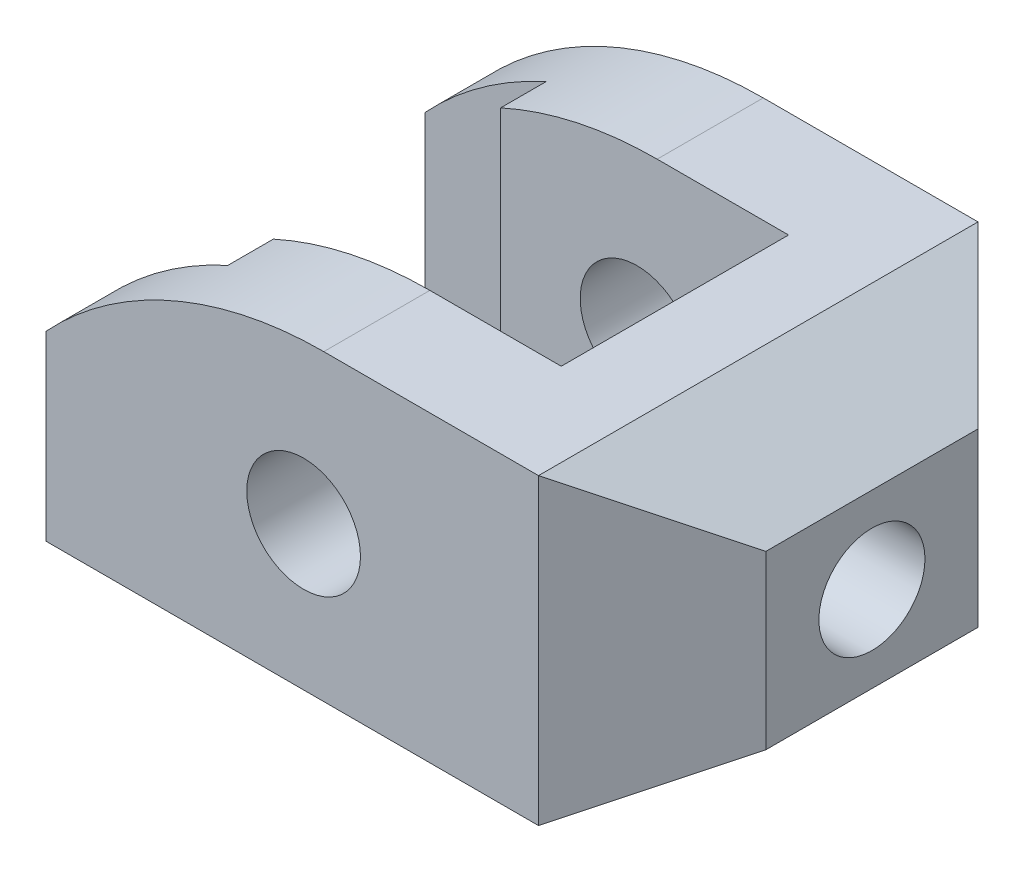
ISO-10303-21;
HEADER;
FILE_DESCRIPTION(('STEP AP214'),'2;1');
FILE_NAME('part.step','',(''),(''),'','','');
FILE_SCHEMA(('AUTOMOTIVE_DESIGN { 1 0 10303 214 1 1 1 1 }'));
ENDSEC;
DATA;
#1=APPLICATION_CONTEXT('core data for automotive mechanical design processes');
#2=APPLICATION_PROTOCOL_DEFINITION('international standard','automotive_design',2000,#1);
#3=PRODUCT_CONTEXT('',#1,'mechanical');
#4=PRODUCT('Part','Part','',(#3));
#5=PRODUCT_RELATED_PRODUCT_CATEGORY('part','',(#4));
#6=PRODUCT_DEFINITION_FORMATION('','',#4);
#7=PRODUCT_DEFINITION_CONTEXT('part definition',#1,'design');
#8=PRODUCT_DEFINITION('design','',#6,#7);
#9=PRODUCT_DEFINITION_SHAPE('','',#8);
#10=(LENGTH_UNIT() NAMED_UNIT(*) SI_UNIT(.MILLI.,.METRE.));
#11=(NAMED_UNIT(*) PLANE_ANGLE_UNIT() SI_UNIT($,.RADIAN.));
#12=(NAMED_UNIT(*) SI_UNIT($,.STERADIAN.) SOLID_ANGLE_UNIT());
#13=UNCERTAINTY_MEASURE_WITH_UNIT(LENGTH_MEASURE(1.E-05),#10,'distance_accuracy_value','');
#14=(GEOMETRIC_REPRESENTATION_CONTEXT(3) GLOBAL_UNCERTAINTY_ASSIGNED_CONTEXT((#13)) GLOBAL_UNIT_ASSIGNED_CONTEXT((#10,
#11,#12)) REPRESENTATION_CONTEXT('',''));
#15=CARTESIAN_POINT('',(0.,0.,0.));
#16=DIRECTION('',(0.,0.,1.));
#17=DIRECTION('',(1.,0.,0.));
#18=AXIS2_PLACEMENT_3D('',#15,#16,#17);
#19=CARTESIAN_POINT('',(2.66060555964671,-29.,58.));
#20=DIRECTION('',(0.,0.,-1.));
#21=DIRECTION('',(-1.,0.,0.));
#22=AXIS2_PLACEMENT_3D('',#19,#20,#21);
#23=PLANE('',#22);
#24=CARTESIAN_POINT('',(0.,0.,58.));
#25=DIRECTION('',(0.,0.,1.));
#26=DIRECTION('',(1.,0.,0.));
#27=AXIS2_PLACEMENT_3D('',#24,#25,#26);
#28=CIRCLE('',#27,7.5);
#29=CARTESIAN_POINT('',(7.5,0.,58.));
#30=VERTEX_POINT('',#29);
#31=EDGE_CURVE('E254',#30,#30,#28,.T.);
#32=ORIENTED_EDGE('',*,*,#31,.F.);
#33=EDGE_LOOP('',(#32));
#34=FACE_BOUND('',#33,.T.);
#35=DIRECTION('',(0.,-1.,0.));
#36=VECTOR('',#35,1.);
#37=CARTESIAN_POINT('',(31.,24.,58.));
#38=LINE('',#37,#36);
#39=CARTESIAN_POINT('',(31.,21.,58.));
#40=VERTEX_POINT('',#39);
#41=CARTESIAN_POINT('',(31.,-19.,58.));
#42=VERTEX_POINT('',#41);
#43=EDGE_CURVE('E158',#40,#42,#38,.T.);
#44=ORIENTED_EDGE('',*,*,#43,.F.);
#45=DIRECTION('',(-1.,0.,0.));
#46=VECTOR('',#45,1.);
#47=CARTESIAN_POINT('',(31.,21.,58.));
#48=LINE('',#47,#46);
#49=CARTESIAN_POINT('',(2.66060555964671,21.,58.));
#50=VERTEX_POINT('',#49);
#51=EDGE_CURVE('E219',#40,#50,#48,.T.);
#52=ORIENTED_EDGE('',*,*,#51,.T.);
#53=CARTESIAN_POINT('',(2.66060555964671,-29.,58.));
#54=DIRECTION('',(0.,0.,1.));
#55=DIRECTION('',(-1.,0.,0.));
#56=AXIS2_PLACEMENT_3D('',#53,#54,#55);
#57=CIRCLE('',#56,50.);
#58=CARTESIAN_POINT('',(-34.,5.,58.));
#59=VERTEX_POINT('',#58);
#60=EDGE_CURVE('E239',#50,#59,#57,.T.);
#61=ORIENTED_EDGE('',*,*,#60,.T.);
#62=DIRECTION('',(0.,-1.,0.));
#63=VECTOR('',#62,1.);
#64=CARTESIAN_POINT('',(-34.,-19.,58.));
#65=LINE('',#64,#63);
#66=CARTESIAN_POINT('',(-34.,-19.,58.));
#67=VERTEX_POINT('',#66);
#68=EDGE_CURVE('E245',#59,#67,#65,.T.);
#69=ORIENTED_EDGE('',*,*,#68,.T.);
#70=DIRECTION('',(1.,0.,0.));
#71=VECTOR('',#70,1.);
#72=CARTESIAN_POINT('',(-34.,-19.,58.));
#73=LINE('',#72,#71);
#74=EDGE_CURVE('E222',#67,#42,#73,.T.);
#75=ORIENTED_EDGE('',*,*,#74,.T.);
#76=EDGE_LOOP('',(#44,#52,#61,#69,#75));
#77=FACE_BOUND('',#76,.T.);
#78=ADVANCED_FACE('F44',(#34,#77),#23,.F.);
#79=CARTESIAN_POINT('',(2.66060555964671,-29.,0.));
#80=DIRECTION('',(0.,0.,-1.));
#81=DIRECTION('',(-1.,0.,0.));
#82=AXIS2_PLACEMENT_3D('',#79,#80,#81);
#83=PLANE('',#82);
#84=CARTESIAN_POINT('',(0.,0.,0.));
#85=DIRECTION('',(0.,0.,1.));
#86=DIRECTION('',(1.,0.,0.));
#87=AXIS2_PLACEMENT_3D('',#84,#85,#86);
#88=CIRCLE('',#87,7.5);
#89=CARTESIAN_POINT('',(7.5,0.,0.));
#90=VERTEX_POINT('',#89);
#91=EDGE_CURVE('E375',#90,#90,#88,.T.);
#92=ORIENTED_EDGE('',*,*,#91,.T.);
#93=EDGE_LOOP('',(#92));
#94=FACE_BOUND('',#93,.T.);
#95=DIRECTION('',(-1.,0.,0.));
#96=VECTOR('',#95,1.);
#97=CARTESIAN_POINT('',(31.,21.,0.));
#98=LINE('',#97,#96);
#99=CARTESIAN_POINT('',(31.,21.,0.));
#100=VERTEX_POINT('',#99);
#101=CARTESIAN_POINT('',(2.66060555964671,21.,0.));
#102=VERTEX_POINT('',#101);
#103=EDGE_CURVE('E258',#100,#102,#98,.T.);
#104=ORIENTED_EDGE('',*,*,#103,.F.);
#105=DIRECTION('',(0.,-1.,0.));
#106=VECTOR('',#105,1.);
#107=CARTESIAN_POINT('',(31.,24.,0.));
#108=LINE('',#107,#106);
#109=CARTESIAN_POINT('',(31.,-19.,0.));
#110=VERTEX_POINT('',#109);
#111=EDGE_CURVE('E176',#100,#110,#108,.T.);
#112=ORIENTED_EDGE('',*,*,#111,.T.);
#113=DIRECTION('',(1.,0.,0.));
#114=VECTOR('',#113,1.);
#115=CARTESIAN_POINT('',(-34.,-19.,0.));
#116=LINE('',#115,#114);
#117=CARTESIAN_POINT('',(-34.,-19.,0.));
#118=VERTEX_POINT('',#117);
#119=EDGE_CURVE('E253',#118,#110,#116,.T.);
#120=ORIENTED_EDGE('',*,*,#119,.F.);
#121=DIRECTION('',(0.,-1.,0.));
#122=VECTOR('',#121,1.);
#123=CARTESIAN_POINT('',(-34.,-19.,0.));
#124=LINE('',#123,#122);
#125=CARTESIAN_POINT('',(-34.,5.,0.));
#126=VERTEX_POINT('',#125);
#127=EDGE_CURVE('E249',#126,#118,#124,.T.);
#128=ORIENTED_EDGE('',*,*,#127,.F.);
#129=CARTESIAN_POINT('',(2.66060555964671,-29.,0.));
#130=DIRECTION('',(0.,0.,1.));
#131=DIRECTION('',(-1.,0.,0.));
#132=AXIS2_PLACEMENT_3D('',#129,#130,#131);
#133=CIRCLE('',#132,50.);
#134=EDGE_CURVE('E261',#102,#126,#133,.T.);
#135=ORIENTED_EDGE('',*,*,#134,.F.);
#136=EDGE_LOOP('',(#104,#112,#120,#128,#135));
#137=FACE_BOUND('',#136,.T.);
#138=ADVANCED_FACE('F285',(#94,#137),#83,.T.);
#139=CARTESIAN_POINT('',(31.,-19.,58.));
#140=DIRECTION('',(-0.500000000000001,0.866025403784438,0.));
#141=DIRECTION('',(-0.866025403784438,-0.500000000000001,0.));
#142=AXIS2_PLACEMENT_3D('',#139,#140,#141);
#143=PLANE('',#142);
#144=DIRECTION('',(-0.65465367070798,-0.37796447300923,-0.654653670707973));
#145=VECTOR('',#144,1.);
#146=CARTESIAN_POINT('',(55.8571428571428,-4.64872188014358,24.8571428571425));
#147=LINE('',#146,#145);
#148=CARTESIAN_POINT('',(46.,-10.3397459621556,14.9999999999998));
#149=VERTEX_POINT('',#148);
#150=EDGE_CURVE('E164',#149,#110,#147,.T.);
#151=ORIENTED_EDGE('',*,*,#150,.F.);
#152=DIRECTION('',(0.,0.,-1.));
#153=VECTOR('',#152,1.);
#154=CARTESIAN_POINT('',(46.,-10.3397459621556,58.));
#155=LINE('',#154,#153);
#156=CARTESIAN_POINT('',(46.,-10.3397459621556,43.0000000000002));
#157=VERTEX_POINT('',#156);
#158=EDGE_CURVE('E172',#157,#149,#155,.T.);
#159=ORIENTED_EDGE('',*,*,#158,.F.);
#160=DIRECTION('',(0.65465367070798,0.37796447300923,-0.654653670707973));
#161=VECTOR('',#160,1.);
#162=CARTESIAN_POINT('',(31.,-19.,58.));
#163=LINE('',#162,#161);
#164=EDGE_CURVE('E155',#42,#157,#163,.T.);
#165=ORIENTED_EDGE('',*,*,#164,.F.);
#166=DIRECTION('',(0.,0.,-1.));
#167=VECTOR('',#166,1.);
#168=CARTESIAN_POINT('',(31.,-19.,58.));
#169=LINE('',#168,#167);
#170=EDGE_CURVE('E181',#42,#110,#169,.T.);
#171=ORIENTED_EDGE('',*,*,#170,.T.);
#172=EDGE_LOOP('',(#151,#159,#165,#171));
#173=FACE_BOUND('',#172,.T.);
#174=ADVANCED_FACE('F179',(#173),#143,.F.);
#175=CARTESIAN_POINT('',(46.,12.3397459621557,58.));
#176=DIRECTION('',(-1.,0.,0.));
#177=DIRECTION('',(0.,0.,1.));
#178=AXIS2_PLACEMENT_3D('',#175,#176,#177);
#179=PLANE('',#178);
#180=CARTESIAN_POINT('',(46.,1.00000000000008,29.));
#181=DIRECTION('',(1.,0.,0.));
#182=DIRECTION('',(0.,0.,-1.));
#183=AXIS2_PLACEMENT_3D('',#180,#181,#182);
#184=CIRCLE('',#183,7.);
#185=CARTESIAN_POINT('',(46.,1.00000000000008,22.));
#186=VERTEX_POINT('',#185);
#187=EDGE_CURVE('E371',#186,#186,#184,.T.);
#188=ORIENTED_EDGE('',*,*,#187,.F.);
#189=EDGE_LOOP('',(#188));
#190=FACE_BOUND('',#189,.T.);
#191=DIRECTION('',(0.,-1.,0.));
#192=VECTOR('',#191,1.);
#193=CARTESIAN_POINT('',(46.,24.,14.9999999999998));
#194=LINE('',#193,#192);
#195=CARTESIAN_POINT('',(46.,12.3397459621557,14.9999999999998));
#196=VERTEX_POINT('',#195);
#197=EDGE_CURVE('E165',#196,#149,#194,.T.);
#198=ORIENTED_EDGE('',*,*,#197,.F.);
#199=DIRECTION('',(0.,0.,-1.));
#200=VECTOR('',#199,1.);
#201=CARTESIAN_POINT('',(46.,12.3397459621557,58.));
#202=LINE('',#201,#200);
#203=CARTESIAN_POINT('',(46.,12.3397459621557,43.0000000000002));
#204=VERTEX_POINT('',#203);
#205=EDGE_CURVE('E174',#204,#196,#202,.T.);
#206=ORIENTED_EDGE('',*,*,#205,.F.);
#207=DIRECTION('',(0.,-1.,0.));
#208=VECTOR('',#207,1.);
#209=CARTESIAN_POINT('',(46.,24.,43.0000000000002));
#210=LINE('',#209,#208);
#211=EDGE_CURVE('E60',#204,#157,#210,.T.);
#212=ORIENTED_EDGE('',*,*,#211,.T.);
#213=ORIENTED_EDGE('',*,*,#158,.T.);
#214=EDGE_LOOP('',(#198,#206,#212,#213));
#215=FACE_BOUND('',#214,.T.);
#216=ADVANCED_FACE('F171',(#190,#215),#179,.F.);
#217=CARTESIAN_POINT('',(31.,21.,58.));
#218=DIRECTION('',(-0.499999999999994,-0.866025403784442,0.));
#219=DIRECTION('',(0.866025403784442,-0.499999999999994,0.));
#220=AXIS2_PLACEMENT_3D('',#217,#218,#219);
#221=PLANE('',#220);
#222=DIRECTION('',(0.654653670707982,-0.377964473009224,0.654653670707974));
#223=VECTOR('',#222,1.);
#224=CARTESIAN_POINT('',(55.8571428571429,6.64872188014377,24.8571428571426));
#225=LINE('',#224,#223);
#226=EDGE_CURVE('E11',#100,#196,#225,.T.);
#227=ORIENTED_EDGE('',*,*,#226,.F.);
#228=DIRECTION('',(0.,0.,-1.));
#229=VECTOR('',#228,1.);
#230=CARTESIAN_POINT('',(31.,21.,58.));
#231=LINE('',#230,#229);
#232=EDGE_CURVE('E187',#40,#100,#231,.T.);
#233=ORIENTED_EDGE('',*,*,#232,.F.);
#234=DIRECTION('',(-0.654653670707982,0.377964473009224,0.654653670707974));
#235=VECTOR('',#234,1.);
#236=CARTESIAN_POINT('',(31.,21.,58.));
#237=LINE('',#236,#235);
#238=EDGE_CURVE('E53',#204,#40,#237,.T.);
#239=ORIENTED_EDGE('',*,*,#238,.F.);
#240=ORIENTED_EDGE('',*,*,#205,.T.);
#241=EDGE_LOOP('',(#227,#233,#239,#240));
#242=FACE_BOUND('',#241,.T.);
#243=ADVANCED_FACE('F228',(#242),#221,.F.);
#244=CARTESIAN_POINT('',(-34.,-19.,58.));
#245=DIRECTION('',(1.,0.,0.));
#246=DIRECTION('',(0.,0.,-1.));
#247=AXIS2_PLACEMENT_3D('',#244,#245,#246);
#248=PLANE('',#247);
#249=DIRECTION('',(0.,0.,-1.));
#250=VECTOR('',#249,1.);
#251=CARTESIAN_POINT('',(-34.,-19.,58.));
#252=LINE('',#251,#250);
#253=CARTESIAN_POINT('',(-34.,-19.,8.));
#254=VERTEX_POINT('',#253);
#255=EDGE_CURVE('E185',#254,#118,#252,.T.);
#256=ORIENTED_EDGE('',*,*,#255,.F.);
#257=DIRECTION('',(0.,1.,0.));
#258=VECTOR('',#257,1.);
#259=CARTESIAN_POINT('',(-34.,-19.,8.));
#260=LINE('',#259,#258);
#261=CARTESIAN_POINT('',(-34.,5.00000000000001,8.));
#262=VERTEX_POINT('',#261);
#263=EDGE_CURVE('E291',#254,#262,#260,.T.);
#264=ORIENTED_EDGE('',*,*,#263,.T.);
#265=DIRECTION('',(0.,0.,-1.));
#266=VECTOR('',#265,1.);
#267=CARTESIAN_POINT('',(-34.,5.,58.));
#268=LINE('',#267,#266);
#269=EDGE_CURVE('E243',#262,#126,#268,.T.);
#270=ORIENTED_EDGE('',*,*,#269,.T.);
#271=ORIENTED_EDGE('',*,*,#127,.T.);
#272=EDGE_LOOP('',(#256,#264,#270,#271));
#273=FACE_BOUND('',#272,.T.);
#274=ADVANCED_FACE('F289',(#273),#248,.F.);
#275=CARTESIAN_POINT('',(-34.,-19.,58.));
#276=DIRECTION('',(0.,1.,0.));
#277=DIRECTION('',(-1.,0.,0.));
#278=AXIS2_PLACEMENT_3D('',#275,#276,#277);
#279=PLANE('',#278);
#280=DIRECTION('',(0.,0.,-1.));
#281=VECTOR('',#280,1.);
#282=CARTESIAN_POINT('',(-18.,-19.,8.));
#283=LINE('',#282,#281);
#284=CARTESIAN_POINT('',(-18.,-19.,14.));
#285=VERTEX_POINT('',#284);
#286=CARTESIAN_POINT('',(-18.,-19.,8.));
#287=VERTEX_POINT('',#286);
#288=EDGE_CURVE('E68',#285,#287,#283,.T.);
#289=ORIENTED_EDGE('',*,*,#288,.T.);
#290=DIRECTION('',(-1.,0.,0.));
#291=VECTOR('',#290,1.);
#292=CARTESIAN_POINT('',(-34.,-19.,8.));
#293=LINE('',#292,#291);
#294=EDGE_CURVE('E300',#287,#254,#293,.T.);
#295=ORIENTED_EDGE('',*,*,#294,.T.);
#296=ORIENTED_EDGE('',*,*,#255,.T.);
#297=ORIENTED_EDGE('',*,*,#119,.T.);
#298=ORIENTED_EDGE('',*,*,#170,.F.);
#299=ORIENTED_EDGE('',*,*,#74,.F.);
#300=CARTESIAN_POINT('',(-34.,-19.,50.));
#301=VERTEX_POINT('',#300);
#302=EDGE_CURVE('E191',#67,#301,#252,.T.);
#303=ORIENTED_EDGE('',*,*,#302,.T.);
#304=DIRECTION('',(1.,0.,0.));
#305=VECTOR('',#304,1.);
#306=CARTESIAN_POINT('',(-34.,-19.,50.));
#307=LINE('',#306,#305);
#308=CARTESIAN_POINT('',(-18.,-19.,50.));
#309=VERTEX_POINT('',#308);
#310=EDGE_CURVE('E326',#301,#309,#307,.T.);
#311=ORIENTED_EDGE('',*,*,#310,.T.);
#312=DIRECTION('',(0.,0.,-1.));
#313=VECTOR('',#312,1.);
#314=CARTESIAN_POINT('',(-18.,-19.,50.));
#315=LINE('',#314,#313);
#316=CARTESIAN_POINT('',(-18.,-19.,44.));
#317=VERTEX_POINT('',#316);
#318=EDGE_CURVE('E314',#309,#317,#315,.T.);
#319=ORIENTED_EDGE('',*,*,#318,.T.);
#320=DIRECTION('',(-1.,0.,0.));
#321=VECTOR('',#320,1.);
#322=CARTESIAN_POINT('',(-34.,-19.,44.));
#323=LINE('',#322,#321);
#324=CARTESIAN_POINT('',(20.,-19.,44.));
#325=VERTEX_POINT('',#324);
#326=EDGE_CURVE('E211',#325,#317,#323,.T.);
#327=ORIENTED_EDGE('',*,*,#326,.F.);
#328=DIRECTION('',(0.,0.,1.));
#329=VECTOR('',#328,1.);
#330=CARTESIAN_POINT('',(20.,-19.,58.));
#331=LINE('',#330,#329);
#332=CARTESIAN_POINT('',(20.,-19.,14.));
#333=VERTEX_POINT('',#332);
#334=EDGE_CURVE('E205',#333,#325,#331,.T.);
#335=ORIENTED_EDGE('',*,*,#334,.F.);
#336=DIRECTION('',(1.,0.,0.));
#337=VECTOR('',#336,1.);
#338=CARTESIAN_POINT('',(-34.,-19.,14.));
#339=LINE('',#338,#337);
#340=EDGE_CURVE('E368',#285,#333,#339,.T.);
#341=ORIENTED_EDGE('',*,*,#340,.F.);
#342=EDGE_LOOP('',(#289,#295,#296,#297,#298,#299,#303,#311,#319,#327,#335,#341));
#343=FACE_BOUND('',#342,.T.);
#344=ADVANCED_FACE('F388',(#343),#279,.F.);
#345=CARTESIAN_POINT('',(31.,21.,58.));
#346=DIRECTION('',(0.,-1.,0.));
#347=DIRECTION('',(1.,0.,0.));
#348=AXIS2_PLACEMENT_3D('',#345,#346,#347);
#349=PLANE('',#348);
#350=DIRECTION('',(-1.,0.,0.));
#351=VECTOR('',#350,1.);
#352=CARTESIAN_POINT('',(31.,21.,14.));
#353=LINE('',#352,#351);
#354=CARTESIAN_POINT('',(20.,21.,14.));
#355=VERTEX_POINT('',#354);
#356=CARTESIAN_POINT('',(2.66060555964671,21.,14.));
#357=VERTEX_POINT('',#356);
#358=EDGE_CURVE('E365',#355,#357,#353,.T.);
#359=ORIENTED_EDGE('',*,*,#358,.F.);
#360=DIRECTION('',(0.,0.,-1.));
#361=VECTOR('',#360,1.);
#362=CARTESIAN_POINT('',(20.,21.,58.));
#363=LINE('',#362,#361);
#364=CARTESIAN_POINT('',(20.,21.,44.));
#365=VERTEX_POINT('',#364);
#366=EDGE_CURVE('E347',#365,#355,#363,.T.);
#367=ORIENTED_EDGE('',*,*,#366,.F.);
#368=DIRECTION('',(1.,0.,0.));
#369=VECTOR('',#368,1.);
#370=CARTESIAN_POINT('',(31.,21.,44.));
#371=LINE('',#370,#369);
#372=CARTESIAN_POINT('',(2.66060555964671,21.,44.));
#373=VERTEX_POINT('',#372);
#374=EDGE_CURVE('E356',#373,#365,#371,.T.);
#375=ORIENTED_EDGE('',*,*,#374,.F.);
#376=DIRECTION('',(0.,0.,-1.));
#377=VECTOR('',#376,1.);
#378=CARTESIAN_POINT('',(2.66060555964671,21.,58.));
#379=LINE('',#378,#377);
#380=EDGE_CURVE('E233',#50,#373,#379,.T.);
#381=ORIENTED_EDGE('',*,*,#380,.F.);
#382=ORIENTED_EDGE('',*,*,#51,.F.);
#383=ORIENTED_EDGE('',*,*,#232,.T.);
#384=ORIENTED_EDGE('',*,*,#103,.T.);
#385=EDGE_CURVE('E269',#357,#102,#379,.T.);
#386=ORIENTED_EDGE('',*,*,#385,.F.);
#387=EDGE_LOOP('',(#359,#367,#375,#381,#382,#383,#384,#386));
#388=FACE_BOUND('',#387,.T.);
#389=ADVANCED_FACE('F234',(#388),#349,.F.);
#390=CARTESIAN_POINT('',(2.66060555964671,-29.,58.));
#391=DIRECTION('',(0.,0.,-1.));
#392=DIRECTION('',(-1.,0.,0.));
#393=AXIS2_PLACEMENT_3D('',#390,#391,#392);
#394=CYLINDRICAL_SURFACE('',#393,50.);
#395=ORIENTED_EDGE('',*,*,#269,.F.);
#396=CARTESIAN_POINT('',(2.66060555964671,-29.,8.));
#397=DIRECTION('',(0.,0.,-1.));
#398=DIRECTION('',(-1.,0.,0.));
#399=AXIS2_PLACEMENT_3D('',#396,#397,#398);
#400=CIRCLE('',#399,50.);
#401=CARTESIAN_POINT('',(-18.,16.5317403347236,8.));
#402=VERTEX_POINT('',#401);
#403=EDGE_CURVE('E199',#262,#402,#400,.T.);
#404=ORIENTED_EDGE('',*,*,#403,.T.);
#405=DIRECTION('',(0.,0.,-1.));
#406=VECTOR('',#405,1.);
#407=CARTESIAN_POINT('',(-18.,16.5317403347236,58.));
#408=LINE('',#407,#406);
#409=CARTESIAN_POINT('',(-18.,16.5317403347236,14.));
#410=VERTEX_POINT('',#409);
#411=EDGE_CURVE('E293',#402,#410,#408,.F.);
#412=ORIENTED_EDGE('',*,*,#411,.T.);
#413=CARTESIAN_POINT('',(2.66060555964671,-29.,14.));
#414=DIRECTION('',(0.,0.,1.));
#415=DIRECTION('',(1.,0.,0.));
#416=AXIS2_PLACEMENT_3D('',#413,#414,#415);
#417=CIRCLE('',#416,50.);
#418=EDGE_CURVE('E210',#357,#410,#417,.T.);
#419=ORIENTED_EDGE('',*,*,#418,.F.);
#420=ORIENTED_EDGE('',*,*,#385,.T.);
#421=ORIENTED_EDGE('',*,*,#134,.T.);
#422=EDGE_LOOP('',(#395,#404,#412,#419,#420,#421));
#423=FACE_BOUND('',#422,.T.);
#424=ADVANCED_FACE('F277',(#423),#394,.T.);
#425=CARTESIAN_POINT('',(2.66060555964671,-29.,44.));
#426=DIRECTION('',(0.,0.,-1.));
#427=DIRECTION('',(-1.,0.,0.));
#428=AXIS2_PLACEMENT_3D('',#425,#426,#427);
#429=CIRCLE('',#428,50.);
#430=CARTESIAN_POINT('',(-18.,16.5317403347236,44.));
#431=VERTEX_POINT('',#430);
#432=EDGE_CURVE('E204',#431,#373,#429,.T.);
#433=ORIENTED_EDGE('',*,*,#432,.F.);
#434=DIRECTION('',(0.,0.,-1.));
#435=VECTOR('',#434,1.);
#436=CARTESIAN_POINT('',(-18.,16.5317403347236,58.));
#437=LINE('',#436,#435);
#438=CARTESIAN_POINT('',(-18.,16.5317403347236,50.));
#439=VERTEX_POINT('',#438);
#440=EDGE_CURVE('E306',#431,#439,#437,.F.);
#441=ORIENTED_EDGE('',*,*,#440,.T.);
#442=CARTESIAN_POINT('',(2.66060555964671,-29.,50.));
#443=DIRECTION('',(0.,0.,1.));
#444=DIRECTION('',(1.,0.,0.));
#445=AXIS2_PLACEMENT_3D('',#442,#443,#444);
#446=CIRCLE('',#445,50.);
#447=CARTESIAN_POINT('',(-34.,5.,50.));
#448=VERTEX_POINT('',#447);
#449=EDGE_CURVE('E335',#439,#448,#446,.T.);
#450=ORIENTED_EDGE('',*,*,#449,.T.);
#451=EDGE_CURVE('E265',#59,#448,#268,.T.);
#452=ORIENTED_EDGE('',*,*,#451,.F.);
#453=ORIENTED_EDGE('',*,*,#60,.F.);
#454=ORIENTED_EDGE('',*,*,#380,.T.);
#455=EDGE_LOOP('',(#433,#441,#450,#452,#453,#454));
#456=FACE_BOUND('',#455,.T.);
#457=ADVANCED_FACE('F425',(#456),#394,.T.);
#458=CARTESIAN_POINT('',(0.,0.,58.));
#459=DIRECTION('',(0.,0.,-1.));
#460=DIRECTION('',(-1.,0.,0.));
#461=AXIS2_PLACEMENT_3D('',#458,#459,#460);
#462=CYLINDRICAL_SURFACE('',#461,7.5);
#463=ORIENTED_EDGE('',*,*,#91,.F.);
#464=EDGE_LOOP('',(#463));
#465=FACE_BOUND('',#464,.T.);
#466=CARTESIAN_POINT('',(0.,0.,14.));
#467=DIRECTION('',(0.,0.,1.));
#468=DIRECTION('',(1.,0.,0.));
#469=AXIS2_PLACEMENT_3D('',#466,#467,#468);
#470=CIRCLE('',#469,7.5);
#471=CARTESIAN_POINT('',(7.5,0.,14.));
#472=VERTEX_POINT('',#471);
#473=EDGE_CURVE('E206',#472,#472,#470,.T.);
#474=ORIENTED_EDGE('',*,*,#473,.T.);
#475=EDGE_LOOP('',(#474));
#476=FACE_BOUND('',#475,.T.);
#477=ADVANCED_FACE('F420',(#465,#476),#462,.F.);
#478=ORIENTED_EDGE('',*,*,#31,.T.);
#479=EDGE_LOOP('',(#478));
#480=FACE_BOUND('',#479,.T.);
#481=CARTESIAN_POINT('',(0.,0.,44.));
#482=DIRECTION('',(0.,0.,-1.));
#483=DIRECTION('',(-1.,0.,0.));
#484=AXIS2_PLACEMENT_3D('',#481,#482,#483);
#485=CIRCLE('',#484,7.5);
#486=CARTESIAN_POINT('',(-7.5,0.,44.));
#487=VERTEX_POINT('',#486);
#488=EDGE_CURVE('E200',#487,#487,#485,.T.);
#489=ORIENTED_EDGE('',*,*,#488,.T.);
#490=EDGE_LOOP('',(#489));
#491=FACE_BOUND('',#490,.T.);
#492=ADVANCED_FACE('F452',(#480,#491),#462,.F.);
#493=CARTESIAN_POINT('',(-34.,1.00000000000008,29.));
#494=DIRECTION('',(1.,0.,0.));
#495=DIRECTION('',(0.,0.,-1.));
#496=AXIS2_PLACEMENT_3D('',#493,#494,#495);
#497=CYLINDRICAL_SURFACE('',#496,7.);
#498=ORIENTED_EDGE('',*,*,#187,.T.);
#499=EDGE_LOOP('',(#498));
#500=FACE_BOUND('',#499,.T.);
#501=CARTESIAN_POINT('',(20.,1.00000000000008,29.));
#502=DIRECTION('',(-1.,0.,0.));
#503=DIRECTION('',(0.,0.,1.));
#504=AXIS2_PLACEMENT_3D('',#501,#502,#503);
#505=CIRCLE('',#504,7.);
#506=CARTESIAN_POINT('',(20.,1.00000000000008,36.));
#507=VERTEX_POINT('',#506);
#508=EDGE_CURVE('E195',#507,#507,#505,.F.);
#509=ORIENTED_EDGE('',*,*,#508,.F.);
#510=EDGE_LOOP('',(#509));
#511=FACE_BOUND('',#510,.T.);
#512=ADVANCED_FACE('F443',(#500,#511),#497,.F.);
#513=ORIENTED_EDGE('',*,*,#451,.T.);
#514=DIRECTION('',(0.,1.,0.));
#515=VECTOR('',#514,1.);
#516=CARTESIAN_POINT('',(-34.,-19.,50.));
#517=LINE('',#516,#515);
#518=EDGE_CURVE('E311',#301,#448,#517,.T.);
#519=ORIENTED_EDGE('',*,*,#518,.F.);
#520=ORIENTED_EDGE('',*,*,#302,.F.);
#521=ORIENTED_EDGE('',*,*,#68,.F.);
#522=EDGE_LOOP('',(#513,#519,#520,#521));
#523=FACE_BOUND('',#522,.T.);
#524=ADVANCED_FACE('F46',(#523),#248,.F.);
#525=CARTESIAN_POINT('',(-34.,157.69619623991,14.));
#526=DIRECTION('',(0.,0.,1.));
#527=DIRECTION('',(1.,0.,0.));
#528=AXIS2_PLACEMENT_3D('',#525,#526,#527);
#529=PLANE('',#528);
#530=DIRECTION('',(0.,1.,0.));
#531=VECTOR('',#530,1.);
#532=CARTESIAN_POINT('',(-18.,-19.,14.));
#533=LINE('',#532,#531);
#534=EDGE_CURVE('E302',#285,#410,#533,.T.);
#535=ORIENTED_EDGE('',*,*,#534,.F.);
#536=ORIENTED_EDGE('',*,*,#340,.T.);
#537=DIRECTION('',(0.,-1.,0.));
#538=VECTOR('',#537,1.);
#539=CARTESIAN_POINT('',(20.,157.69619623991,14.));
#540=LINE('',#539,#538);
#541=EDGE_CURVE('E343',#355,#333,#540,.T.);
#542=ORIENTED_EDGE('',*,*,#541,.F.);
#543=ORIENTED_EDGE('',*,*,#358,.T.);
#544=ORIENTED_EDGE('',*,*,#418,.T.);
#545=EDGE_LOOP('',(#535,#536,#542,#543,#544));
#546=FACE_BOUND('',#545,.T.);
#547=ORIENTED_EDGE('',*,*,#473,.F.);
#548=EDGE_LOOP('',(#547));
#549=FACE_BOUND('',#548,.T.);
#550=ADVANCED_FACE('F442',(#546,#549),#529,.T.);
#551=CARTESIAN_POINT('',(-34.,157.69619623991,44.));
#552=DIRECTION('',(0.,0.,-1.));
#553=DIRECTION('',(-1.,0.,0.));
#554=AXIS2_PLACEMENT_3D('',#551,#552,#553);
#555=PLANE('',#554);
#556=DIRECTION('',(0.,1.,0.));
#557=VECTOR('',#556,1.);
#558=CARTESIAN_POINT('',(-18.,-19.,44.));
#559=LINE('',#558,#557);
#560=EDGE_CURVE('E319',#317,#431,#559,.T.);
#561=ORIENTED_EDGE('',*,*,#560,.T.);
#562=ORIENTED_EDGE('',*,*,#432,.T.);
#563=ORIENTED_EDGE('',*,*,#374,.T.);
#564=DIRECTION('',(0.,-1.,0.));
#565=VECTOR('',#564,1.);
#566=CARTESIAN_POINT('',(20.,157.69619623991,44.));
#567=LINE('',#566,#565);
#568=EDGE_CURVE('E339',#365,#325,#567,.T.);
#569=ORIENTED_EDGE('',*,*,#568,.T.);
#570=ORIENTED_EDGE('',*,*,#326,.T.);
#571=EDGE_LOOP('',(#561,#562,#563,#569,#570));
#572=FACE_BOUND('',#571,.T.);
#573=ORIENTED_EDGE('',*,*,#488,.F.);
#574=EDGE_LOOP('',(#573));
#575=FACE_BOUND('',#574,.T.);
#576=ADVANCED_FACE('F448',(#572,#575),#555,.T.);
#577=CARTESIAN_POINT('',(20.,157.69619623991,14.));
#578=DIRECTION('',(-1.,0.,0.));
#579=DIRECTION('',(0.,0.,1.));
#580=AXIS2_PLACEMENT_3D('',#577,#578,#579);
#581=PLANE('',#580);
#582=ORIENTED_EDGE('',*,*,#508,.T.);
#583=EDGE_LOOP('',(#582));
#584=FACE_BOUND('',#583,.T.);
#585=ORIENTED_EDGE('',*,*,#541,.T.);
#586=ORIENTED_EDGE('',*,*,#334,.T.);
#587=ORIENTED_EDGE('',*,*,#568,.F.);
#588=ORIENTED_EDGE('',*,*,#366,.T.);
#589=EDGE_LOOP('',(#585,#586,#587,#588));
#590=FACE_BOUND('',#589,.T.);
#591=ADVANCED_FACE('F460',(#584,#590),#581,.T.);
#592=CARTESIAN_POINT('',(-34.,-19.,50.));
#593=DIRECTION('',(0.,0.,1.));
#594=DIRECTION('',(1.,0.,0.));
#595=AXIS2_PLACEMENT_3D('',#592,#593,#594);
#596=PLANE('',#595);
#597=DIRECTION('',(0.,1.,0.));
#598=VECTOR('',#597,1.);
#599=CARTESIAN_POINT('',(-18.,-19.,50.));
#600=LINE('',#599,#598);
#601=EDGE_CURVE('E315',#309,#439,#600,.T.);
#602=ORIENTED_EDGE('',*,*,#601,.F.);
#603=ORIENTED_EDGE('',*,*,#310,.F.);
#604=ORIENTED_EDGE('',*,*,#518,.T.);
#605=ORIENTED_EDGE('',*,*,#449,.F.);
#606=EDGE_LOOP('',(#602,#603,#604,#605));
#607=FACE_BOUND('',#606,.T.);
#608=ADVANCED_FACE('F462',(#607),#596,.F.);
#609=CARTESIAN_POINT('',(-18.,-19.,50.));
#610=DIRECTION('',(1.,0.,0.));
#611=DIRECTION('',(0.,0.,-1.));
#612=AXIS2_PLACEMENT_3D('',#609,#610,#611);
#613=PLANE('',#612);
#614=ORIENTED_EDGE('',*,*,#560,.F.);
#615=ORIENTED_EDGE('',*,*,#318,.F.);
#616=ORIENTED_EDGE('',*,*,#601,.T.);
#617=ORIENTED_EDGE('',*,*,#440,.F.);
#618=EDGE_LOOP('',(#614,#615,#616,#617));
#619=FACE_BOUND('',#618,.T.);
#620=ADVANCED_FACE('F467',(#619),#613,.F.);
#621=CARTESIAN_POINT('',(-34.,-19.,8.));
#622=DIRECTION('',(0.,0.,-1.));
#623=DIRECTION('',(-1.,0.,0.));
#624=AXIS2_PLACEMENT_3D('',#621,#622,#623);
#625=PLANE('',#624);
#626=ORIENTED_EDGE('',*,*,#263,.F.);
#627=ORIENTED_EDGE('',*,*,#294,.F.);
#628=DIRECTION('',(0.,1.,0.));
#629=VECTOR('',#628,1.);
#630=CARTESIAN_POINT('',(-18.,-19.,8.));
#631=LINE('',#630,#629);
#632=EDGE_CURVE('E299',#287,#402,#631,.T.);
#633=ORIENTED_EDGE('',*,*,#632,.T.);
#634=ORIENTED_EDGE('',*,*,#403,.F.);
#635=EDGE_LOOP('',(#626,#627,#633,#634));
#636=FACE_BOUND('',#635,.T.);
#637=ADVANCED_FACE('F296',(#636),#625,.F.);
#638=CARTESIAN_POINT('',(-18.,-19.,8.));
#639=DIRECTION('',(1.,0.,0.));
#640=DIRECTION('',(0.,0.,-1.));
#641=AXIS2_PLACEMENT_3D('',#638,#639,#640);
#642=PLANE('',#641);
#643=ORIENTED_EDGE('',*,*,#632,.F.);
#644=ORIENTED_EDGE('',*,*,#288,.F.);
#645=ORIENTED_EDGE('',*,*,#534,.T.);
#646=ORIENTED_EDGE('',*,*,#411,.F.);
#647=EDGE_LOOP('',(#643,#644,#645,#646));
#648=FACE_BOUND('',#647,.T.);
#649=ADVANCED_FACE('F407',(#648),#642,.F.);
#650=CARTESIAN_POINT('',(46.,24.,43.0000000000002));
#651=DIRECTION('',(0.707106781186544,0.,0.707106781186551));
#652=DIRECTION('',(0.707106781186551,0.,-0.707106781186544));
#653=AXIS2_PLACEMENT_3D('',#650,#651,#652);
#654=PLANE('',#653);
#655=ORIENTED_EDGE('',*,*,#164,.T.);
#656=ORIENTED_EDGE('',*,*,#211,.F.);
#657=ORIENTED_EDGE('',*,*,#238,.T.);
#658=ORIENTED_EDGE('',*,*,#43,.T.);
#659=EDGE_LOOP('',(#655,#656,#657,#658));
#660=FACE_BOUND('',#659,.T.);
#661=ADVANCED_FACE('F156',(#660),#654,.T.);
#662=CARTESIAN_POINT('',(46.,24.,14.9999999999998));
#663=DIRECTION('',(0.707106781186543,0.,-0.707106781186552));
#664=DIRECTION('',(-0.707106781186552,0.,-0.707106781186543));
#665=AXIS2_PLACEMENT_3D('',#662,#663,#664);
#666=PLANE('',#665);
#667=ORIENTED_EDGE('',*,*,#150,.T.);
#668=ORIENTED_EDGE('',*,*,#111,.F.);
#669=ORIENTED_EDGE('',*,*,#226,.T.);
#670=ORIENTED_EDGE('',*,*,#197,.T.);
#671=EDGE_LOOP('',(#667,#668,#669,#670));
#672=FACE_BOUND('',#671,.T.);
#673=ADVANCED_FACE('F401',(#672),#666,.T.);
#674=CLOSED_SHELL('',(#78,#138,#174,#216,#243,#274,#344,#389,#424,#457,#477,#492,#512,#524,#550,
#576,#591,#608,#620,#637,#649,#661,#673));
#675=MANIFOLD_SOLID_BREP('B2',#674);
#676=ADVANCED_BREP_SHAPE_REPRESENTATION('',(#18,#675),#14);
#677=SHAPE_DEFINITION_REPRESENTATION(#9,#676);
ENDSEC;
END-ISO-10303-21;
